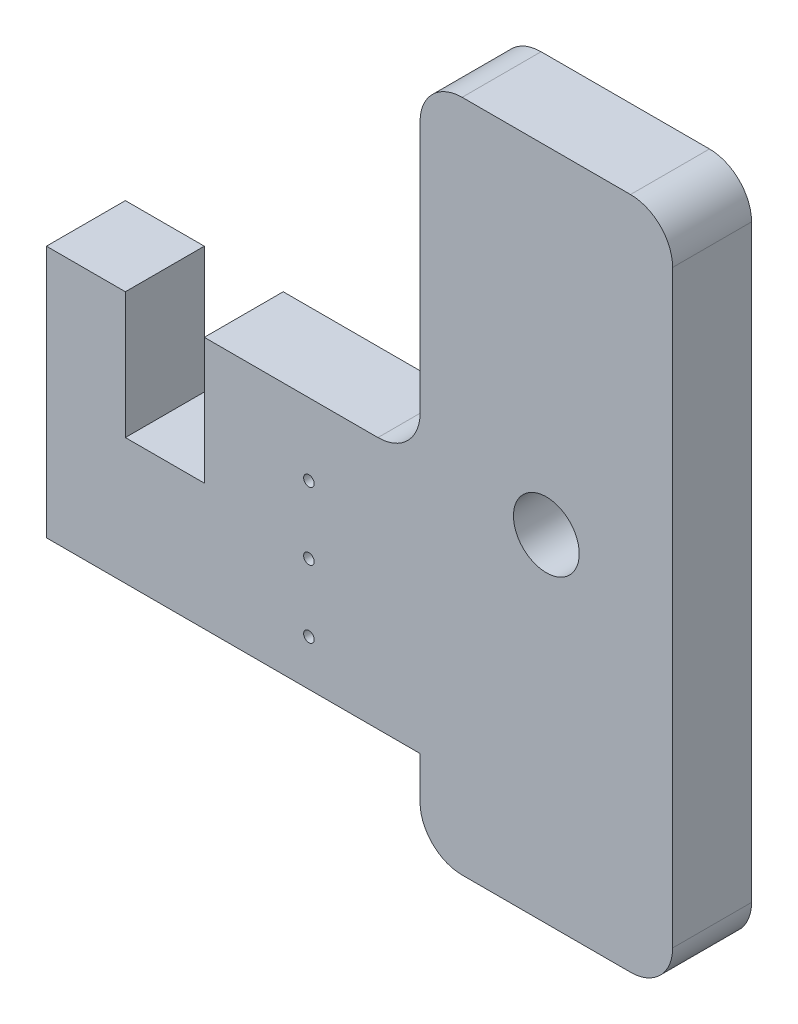
ISO-10303-21;
HEADER;
FILE_DESCRIPTION(('STEP AP214'),'2;1');
FILE_NAME('part.step','',(''),(''),'','','');
FILE_SCHEMA(('AUTOMOTIVE_DESIGN { 1 0 10303 214 1 1 1 1 }'));
ENDSEC;
DATA;
#1=APPLICATION_CONTEXT('core data for automotive mechanical design processes');
#2=APPLICATION_PROTOCOL_DEFINITION('international standard','automotive_design',2000,#1);
#3=PRODUCT_CONTEXT('',#1,'mechanical');
#4=PRODUCT('Part','Part','',(#3));
#5=PRODUCT_RELATED_PRODUCT_CATEGORY('part','',(#4));
#6=PRODUCT_DEFINITION_FORMATION('','',#4);
#7=PRODUCT_DEFINITION_CONTEXT('part definition',#1,'design');
#8=PRODUCT_DEFINITION('design','',#6,#7);
#9=PRODUCT_DEFINITION_SHAPE('','',#8);
#10=(LENGTH_UNIT() NAMED_UNIT(*) SI_UNIT(.MILLI.,.METRE.));
#11=(NAMED_UNIT(*) PLANE_ANGLE_UNIT() SI_UNIT($,.RADIAN.));
#12=(NAMED_UNIT(*) SI_UNIT($,.STERADIAN.) SOLID_ANGLE_UNIT());
#13=UNCERTAINTY_MEASURE_WITH_UNIT(LENGTH_MEASURE(1.E-05),#10,'distance_accuracy_value','');
#14=(GEOMETRIC_REPRESENTATION_CONTEXT(3) GLOBAL_UNCERTAINTY_ASSIGNED_CONTEXT((#13)) GLOBAL_UNIT_ASSIGNED_CONTEXT((#10,
#11,#12)) REPRESENTATION_CONTEXT('',''));
#15=CARTESIAN_POINT('',(0.,0.,0.));
#16=DIRECTION('',(0.,0.,1.));
#17=DIRECTION('',(1.,0.,0.));
#18=AXIS2_PLACEMENT_3D('',#15,#16,#17);
#19=CARTESIAN_POINT('',(0.,0.,9.525));
#20=DIRECTION('',(0.,1.,0.));
#21=DIRECTION('',(-1.,0.,0.));
#22=AXIS2_PLACEMENT_3D('',#19,#20,#21);
#23=PLANE('',#22);
#24=DIRECTION('',(1.,0.,0.));
#25=VECTOR('',#24,1.);
#26=CARTESIAN_POINT('',(0.,0.,9.525));
#27=LINE('',#26,#25);
#28=CARTESIAN_POINT('',(-41.275,0.,9.525));
#29=VERTEX_POINT('',#28);
#30=CARTESIAN_POINT('',(-20.32,0.,9.525));
#31=VERTEX_POINT('',#30);
#32=EDGE_CURVE('E163',#29,#31,#27,.T.);
#33=ORIENTED_EDGE('',*,*,#32,.T.);
#34=DIRECTION('',(0.,0.,-1.));
#35=VECTOR('',#34,1.);
#36=CARTESIAN_POINT('',(-20.32,0.,9.525));
#37=LINE('',#36,#35);
#38=CARTESIAN_POINT('',(-20.32,0.,0.));
#39=VERTEX_POINT('',#38);
#40=EDGE_CURVE('E171',#31,#39,#37,.T.);
#41=ORIENTED_EDGE('',*,*,#40,.T.);
#42=DIRECTION('',(1.,0.,0.));
#43=VECTOR('',#42,1.);
#44=CARTESIAN_POINT('',(0.,0.,0.));
#45=LINE('',#44,#43);
#46=CARTESIAN_POINT('',(-41.275,0.,0.));
#47=VERTEX_POINT('',#46);
#48=EDGE_CURVE('E166',#47,#39,#45,.T.);
#49=ORIENTED_EDGE('',*,*,#48,.F.);
#50=DIRECTION('',(0.,0.,-1.));
#51=VECTOR('',#50,1.);
#52=CARTESIAN_POINT('',(-41.275,0.,9.525));
#53=LINE('',#52,#51);
#54=EDGE_CURVE('E160',#29,#47,#53,.T.);
#55=ORIENTED_EDGE('',*,*,#54,.F.);
#56=EDGE_LOOP('',(#33,#41,#49,#55));
#57=FACE_BOUND('',#56,.T.);
#58=ADVANCED_FACE('F40',(#57),#23,.T.);
#59=CARTESIAN_POINT('',(-41.275,0.,9.525));
#60=DIRECTION('',(-1.,0.,0.));
#61=DIRECTION('',(0.,0.,1.));
#62=AXIS2_PLACEMENT_3D('',#59,#60,#61);
#63=PLANE('',#62);
#64=DIRECTION('',(0.,1.,0.));
#65=VECTOR('',#64,1.);
#66=CARTESIAN_POINT('',(-41.275,0.,0.));
#67=LINE('',#66,#65);
#68=CARTESIAN_POINT('',(-41.275,-15.24,0.));
#69=VERTEX_POINT('',#68);
#70=EDGE_CURVE('E218',#69,#47,#67,.T.);
#71=ORIENTED_EDGE('',*,*,#70,.F.);
#72=DIRECTION('',(0.,0.,-1.));
#73=VECTOR('',#72,1.);
#74=CARTESIAN_POINT('',(-41.275,-15.24,9.525));
#75=LINE('',#74,#73);
#76=CARTESIAN_POINT('',(-41.275,-15.24,9.525));
#77=VERTEX_POINT('',#76);
#78=EDGE_CURVE('E172',#77,#69,#75,.T.);
#79=ORIENTED_EDGE('',*,*,#78,.F.);
#80=DIRECTION('',(0.,1.,0.));
#81=VECTOR('',#80,1.);
#82=CARTESIAN_POINT('',(-41.275,0.,9.525));
#83=LINE('',#82,#81);
#84=EDGE_CURVE('E178',#77,#29,#83,.T.);
#85=ORIENTED_EDGE('',*,*,#84,.T.);
#86=ORIENTED_EDGE('',*,*,#54,.T.);
#87=EDGE_LOOP('',(#71,#79,#85,#86));
#88=FACE_BOUND('',#87,.T.);
#89=ADVANCED_FACE('F184',(#88),#63,.T.);
#90=CARTESIAN_POINT('',(0.,-15.24,9.525));
#91=DIRECTION('',(0.,1.,0.));
#92=DIRECTION('',(-1.,0.,0.));
#93=AXIS2_PLACEMENT_3D('',#90,#91,#92);
#94=PLANE('',#93);
#95=DIRECTION('',(1.,0.,0.));
#96=VECTOR('',#95,1.);
#97=CARTESIAN_POINT('',(0.,-15.24,0.));
#98=LINE('',#97,#96);
#99=CARTESIAN_POINT('',(-50.8,-15.24,0.));
#100=VERTEX_POINT('',#99);
#101=EDGE_CURVE('E220',#100,#69,#98,.T.);
#102=ORIENTED_EDGE('',*,*,#101,.F.);
#103=DIRECTION('',(0.,0.,-1.));
#104=VECTOR('',#103,1.);
#105=CARTESIAN_POINT('',(-50.8,-15.24,9.525));
#106=LINE('',#105,#104);
#107=CARTESIAN_POINT('',(-50.8,-15.24,9.525));
#108=VERTEX_POINT('',#107);
#109=EDGE_CURVE('E258',#108,#100,#106,.T.);
#110=ORIENTED_EDGE('',*,*,#109,.F.);
#111=DIRECTION('',(1.,0.,0.));
#112=VECTOR('',#111,1.);
#113=CARTESIAN_POINT('',(0.,-15.24,9.525));
#114=LINE('',#113,#112);
#115=EDGE_CURVE('E185',#108,#77,#114,.T.);
#116=ORIENTED_EDGE('',*,*,#115,.T.);
#117=ORIENTED_EDGE('',*,*,#78,.T.);
#118=EDGE_LOOP('',(#102,#110,#116,#117));
#119=FACE_BOUND('',#118,.T.);
#120=ADVANCED_FACE('F326',(#119),#94,.T.);
#121=CARTESIAN_POINT('',(-50.8,0.,9.525));
#122=DIRECTION('',(-1.,0.,0.));
#123=DIRECTION('',(0.,0.,1.));
#124=AXIS2_PLACEMENT_3D('',#121,#122,#123);
#125=PLANE('',#124);
#126=DIRECTION('',(0.,1.,0.));
#127=VECTOR('',#126,1.);
#128=CARTESIAN_POINT('',(-50.8,0.,0.));
#129=LINE('',#128,#127);
#130=CARTESIAN_POINT('',(-50.8,0.,0.));
#131=VERTEX_POINT('',#130);
#132=EDGE_CURVE('E223',#100,#131,#129,.T.);
#133=ORIENTED_EDGE('',*,*,#132,.T.);
#134=DIRECTION('',(0.,0.,-1.));
#135=VECTOR('',#134,1.);
#136=CARTESIAN_POINT('',(-50.8,0.,9.525));
#137=LINE('',#136,#135);
#138=CARTESIAN_POINT('',(-50.8,0.,9.525));
#139=VERTEX_POINT('',#138);
#140=EDGE_CURVE('E256',#139,#131,#137,.T.);
#141=ORIENTED_EDGE('',*,*,#140,.F.);
#142=DIRECTION('',(0.,1.,0.));
#143=VECTOR('',#142,1.);
#144=CARTESIAN_POINT('',(-50.8,0.,9.525));
#145=LINE('',#144,#143);
#146=EDGE_CURVE('E187',#108,#139,#145,.T.);
#147=ORIENTED_EDGE('',*,*,#146,.F.);
#148=ORIENTED_EDGE('',*,*,#109,.T.);
#149=EDGE_LOOP('',(#133,#141,#147,#148));
#150=FACE_BOUND('',#149,.T.);
#151=ADVANCED_FACE('F414',(#150),#125,.F.);
#152=CARTESIAN_POINT('',(0.,0.,9.525));
#153=DIRECTION('',(0.,1.,0.));
#154=DIRECTION('',(-1.,0.,0.));
#155=AXIS2_PLACEMENT_3D('',#152,#153,#154);
#156=PLANE('',#155);
#157=DIRECTION('',(1.,0.,0.));
#158=VECTOR('',#157,1.);
#159=CARTESIAN_POINT('',(0.,0.,0.));
#160=LINE('',#159,#158);
#161=CARTESIAN_POINT('',(-60.325,0.,0.));
#162=VERTEX_POINT('',#161);
#163=EDGE_CURVE('E226',#162,#131,#160,.T.);
#164=ORIENTED_EDGE('',*,*,#163,.F.);
#165=DIRECTION('',(0.,0.,-1.));
#166=VECTOR('',#165,1.);
#167=CARTESIAN_POINT('',(-60.325,0.,9.525));
#168=LINE('',#167,#166);
#169=CARTESIAN_POINT('',(-60.325,0.,9.525));
#170=VERTEX_POINT('',#169);
#171=EDGE_CURVE('E254',#170,#162,#168,.T.);
#172=ORIENTED_EDGE('',*,*,#171,.F.);
#173=DIRECTION('',(1.,0.,0.));
#174=VECTOR('',#173,1.);
#175=CARTESIAN_POINT('',(0.,0.,9.525));
#176=LINE('',#175,#174);
#177=EDGE_CURVE('E192',#170,#139,#176,.T.);
#178=ORIENTED_EDGE('',*,*,#177,.T.);
#179=ORIENTED_EDGE('',*,*,#140,.T.);
#180=EDGE_LOOP('',(#164,#172,#178,#179));
#181=FACE_BOUND('',#180,.T.);
#182=ADVANCED_FACE('F410',(#181),#156,.T.);
#183=CARTESIAN_POINT('',(-60.325,0.,9.525));
#184=DIRECTION('',(1.,0.,0.));
#185=DIRECTION('',(0.,1.,0.));
#186=AXIS2_PLACEMENT_3D('',#183,#184,#185);
#187=PLANE('',#186);
#188=DIRECTION('',(0.,-1.,0.));
#189=VECTOR('',#188,1.);
#190=CARTESIAN_POINT('',(-60.325,0.,0.));
#191=LINE('',#190,#189);
#192=CARTESIAN_POINT('',(-60.325,-30.48,0.));
#193=VERTEX_POINT('',#192);
#194=EDGE_CURVE('E229',#162,#193,#191,.T.);
#195=ORIENTED_EDGE('',*,*,#194,.T.);
#196=DIRECTION('',(0.,0.,-1.));
#197=VECTOR('',#196,1.);
#198=CARTESIAN_POINT('',(-60.325,-30.48,9.525));
#199=LINE('',#198,#197);
#200=CARTESIAN_POINT('',(-60.325,-30.48,9.525));
#201=VERTEX_POINT('',#200);
#202=EDGE_CURVE('E251',#201,#193,#199,.T.);
#203=ORIENTED_EDGE('',*,*,#202,.F.);
#204=DIRECTION('',(0.,-1.,0.));
#205=VECTOR('',#204,1.);
#206=CARTESIAN_POINT('',(-60.325,0.,9.525));
#207=LINE('',#206,#205);
#208=EDGE_CURVE('E195',#170,#201,#207,.T.);
#209=ORIENTED_EDGE('',*,*,#208,.F.);
#210=ORIENTED_EDGE('',*,*,#171,.T.);
#211=EDGE_LOOP('',(#195,#203,#209,#210));
#212=FACE_BOUND('',#211,.T.);
#213=ADVANCED_FACE('F406',(#212),#187,.F.);
#214=CARTESIAN_POINT('',(0.,-30.48,9.525));
#215=DIRECTION('',(0.,1.,0.));
#216=DIRECTION('',(-1.,0.,0.));
#217=AXIS2_PLACEMENT_3D('',#214,#215,#216);
#218=PLANE('',#217);
#219=DIRECTION('',(1.,0.,0.));
#220=VECTOR('',#219,1.);
#221=CARTESIAN_POINT('',(0.,-30.48,0.));
#222=LINE('',#221,#220);
#223=CARTESIAN_POINT('',(-15.24,-30.48,0.));
#224=VERTEX_POINT('',#223);
#225=EDGE_CURVE('E232',#193,#224,#222,.T.);
#226=ORIENTED_EDGE('',*,*,#225,.T.);
#227=DIRECTION('',(0.,0.,-1.));
#228=VECTOR('',#227,1.);
#229=CARTESIAN_POINT('',(-15.24,-30.48,9.525));
#230=LINE('',#229,#228);
#231=CARTESIAN_POINT('',(-15.24,-30.48,9.525));
#232=VERTEX_POINT('',#231);
#233=EDGE_CURVE('E212',#232,#224,#230,.T.);
#234=ORIENTED_EDGE('',*,*,#233,.F.);
#235=DIRECTION('',(1.,0.,0.));
#236=VECTOR('',#235,1.);
#237=CARTESIAN_POINT('',(0.,-30.48,9.525));
#238=LINE('',#237,#236);
#239=EDGE_CURVE('E198',#201,#232,#238,.T.);
#240=ORIENTED_EDGE('',*,*,#239,.F.);
#241=ORIENTED_EDGE('',*,*,#202,.T.);
#242=EDGE_LOOP('',(#226,#234,#240,#241));
#243=FACE_BOUND('',#242,.T.);
#244=ADVANCED_FACE('F402',(#243),#218,.F.);
#245=CARTESIAN_POINT('',(-15.24,0.,9.525));
#246=DIRECTION('',(-1.,0.,0.));
#247=DIRECTION('',(0.,0.,1.));
#248=AXIS2_PLACEMENT_3D('',#245,#246,#247);
#249=PLANE('',#248);
#250=DIRECTION('',(0.,1.,0.));
#251=VECTOR('',#250,1.);
#252=CARTESIAN_POINT('',(-15.24,0.,0.));
#253=LINE('',#252,#251);
#254=CARTESIAN_POINT('',(-15.24,-35.56,0.));
#255=VERTEX_POINT('',#254);
#256=EDGE_CURVE('E235',#255,#224,#253,.T.);
#257=ORIENTED_EDGE('',*,*,#256,.F.);
#258=DIRECTION('',(0.,0.,-1.));
#259=VECTOR('',#258,1.);
#260=CARTESIAN_POINT('',(-15.24,-35.56,9.525));
#261=LINE('',#260,#259);
#262=CARTESIAN_POINT('',(-15.24,-35.56,9.525));
#263=VERTEX_POINT('',#262);
#264=EDGE_CURVE('E280',#255,#263,#261,.F.);
#265=ORIENTED_EDGE('',*,*,#264,.T.);
#266=DIRECTION('',(0.,1.,0.));
#267=VECTOR('',#266,1.);
#268=CARTESIAN_POINT('',(-15.24,0.,9.525));
#269=LINE('',#268,#267);
#270=EDGE_CURVE('E201',#263,#232,#269,.T.);
#271=ORIENTED_EDGE('',*,*,#270,.T.);
#272=ORIENTED_EDGE('',*,*,#233,.T.);
#273=EDGE_LOOP('',(#257,#265,#271,#272));
#274=FACE_BOUND('',#273,.T.);
#275=ADVANCED_FACE('F398',(#274),#249,.T.);
#276=CARTESIAN_POINT('',(0.,-40.64,9.525));
#277=DIRECTION('',(0.,1.,0.));
#278=DIRECTION('',(0.,0.,1.));
#279=AXIS2_PLACEMENT_3D('',#276,#277,#278);
#280=PLANE('',#279);
#281=DIRECTION('',(1.,0.,0.));
#282=VECTOR('',#281,1.);
#283=CARTESIAN_POINT('',(0.,-40.64,9.525));
#284=LINE('',#283,#282);
#285=CARTESIAN_POINT('',(-10.16,-40.64,9.525));
#286=VERTEX_POINT('',#285);
#287=CARTESIAN_POINT('',(10.16,-40.64,9.525));
#288=VERTEX_POINT('',#287);
#289=EDGE_CURVE('E203',#286,#288,#284,.T.);
#290=ORIENTED_EDGE('',*,*,#289,.F.);
#291=DIRECTION('',(0.,0.,-1.));
#292=VECTOR('',#291,1.);
#293=CARTESIAN_POINT('',(-10.16,-40.64,0.));
#294=LINE('',#293,#292);
#295=CARTESIAN_POINT('',(-10.16,-40.64,0.));
#296=VERTEX_POINT('',#295);
#297=EDGE_CURVE('E269',#286,#296,#294,.T.);
#298=ORIENTED_EDGE('',*,*,#297,.T.);
#299=DIRECTION('',(1.,0.,0.));
#300=VECTOR('',#299,1.);
#301=CARTESIAN_POINT('',(0.,-40.64,0.));
#302=LINE('',#301,#300);
#303=CARTESIAN_POINT('',(10.16,-40.64,0.));
#304=VERTEX_POINT('',#303);
#305=EDGE_CURVE('E237',#296,#304,#302,.T.);
#306=ORIENTED_EDGE('',*,*,#305,.T.);
#307=DIRECTION('',(0.,0.,-1.));
#308=VECTOR('',#307,1.);
#309=CARTESIAN_POINT('',(10.16,-40.64,9.525));
#310=LINE('',#309,#308);
#311=EDGE_CURVE('E267',#304,#288,#310,.F.);
#312=ORIENTED_EDGE('',*,*,#311,.T.);
#313=EDGE_LOOP('',(#290,#298,#306,#312));
#314=FACE_BOUND('',#313,.T.);
#315=ADVANCED_FACE('F394',(#314),#280,.F.);
#316=CARTESIAN_POINT('',(15.24,0.,9.525));
#317=DIRECTION('',(-1.,0.,0.));
#318=DIRECTION('',(0.,0.,1.));
#319=AXIS2_PLACEMENT_3D('',#316,#317,#318);
#320=PLANE('',#319);
#321=DIRECTION('',(0.,1.,0.));
#322=VECTOR('',#321,1.);
#323=CARTESIAN_POINT('',(15.24,0.,0.));
#324=LINE('',#323,#322);
#325=CARTESIAN_POINT('',(15.24,-35.56,0.));
#326=VERTEX_POINT('',#325);
#327=CARTESIAN_POINT('',(15.24,35.56,0.));
#328=VERTEX_POINT('',#327);
#329=EDGE_CURVE('E240',#326,#328,#324,.T.);
#330=ORIENTED_EDGE('',*,*,#329,.T.);
#331=DIRECTION('',(0.,0.,-1.));
#332=VECTOR('',#331,1.);
#333=CARTESIAN_POINT('',(15.24,35.56,9.525));
#334=LINE('',#333,#332);
#335=CARTESIAN_POINT('',(15.24,35.56,9.525));
#336=VERTEX_POINT('',#335);
#337=EDGE_CURVE('E296',#328,#336,#334,.F.);
#338=ORIENTED_EDGE('',*,*,#337,.T.);
#339=DIRECTION('',(0.,1.,0.));
#340=VECTOR('',#339,1.);
#341=CARTESIAN_POINT('',(15.24,0.,9.525));
#342=LINE('',#341,#340);
#343=CARTESIAN_POINT('',(15.24,-35.56,9.525));
#344=VERTEX_POINT('',#343);
#345=EDGE_CURVE('E206',#344,#336,#342,.T.);
#346=ORIENTED_EDGE('',*,*,#345,.F.);
#347=DIRECTION('',(0.,0.,-1.));
#348=VECTOR('',#347,1.);
#349=CARTESIAN_POINT('',(15.24,-35.56,9.525));
#350=LINE('',#349,#348);
#351=EDGE_CURVE('E293',#344,#326,#350,.T.);
#352=ORIENTED_EDGE('',*,*,#351,.T.);
#353=EDGE_LOOP('',(#330,#338,#346,#352));
#354=FACE_BOUND('',#353,.T.);
#355=ADVANCED_FACE('F338',(#354),#320,.F.);
#356=CARTESIAN_POINT('',(0.,40.64,9.525));
#357=DIRECTION('',(0.,1.,0.));
#358=DIRECTION('',(0.,0.,1.));
#359=AXIS2_PLACEMENT_3D('',#356,#357,#358);
#360=PLANE('',#359);
#361=DIRECTION('',(1.,0.,0.));
#362=VECTOR('',#361,1.);
#363=CARTESIAN_POINT('',(0.,40.64,0.));
#364=LINE('',#363,#362);
#365=CARTESIAN_POINT('',(-10.16,40.64,0.));
#366=VERTEX_POINT('',#365);
#367=CARTESIAN_POINT('',(10.16,40.64,0.));
#368=VERTEX_POINT('',#367);
#369=EDGE_CURVE('E243',#366,#368,#364,.T.);
#370=ORIENTED_EDGE('',*,*,#369,.F.);
#371=DIRECTION('',(0.,0.,-1.));
#372=VECTOR('',#371,1.);
#373=CARTESIAN_POINT('',(-10.16,40.64,9.525));
#374=LINE('',#373,#372);
#375=CARTESIAN_POINT('',(-10.16,40.64,9.525));
#376=VERTEX_POINT('',#375);
#377=EDGE_CURVE('E62',#366,#376,#374,.F.);
#378=ORIENTED_EDGE('',*,*,#377,.T.);
#379=DIRECTION('',(1.,0.,0.));
#380=VECTOR('',#379,1.);
#381=CARTESIAN_POINT('',(0.,40.64,9.525));
#382=LINE('',#381,#380);
#383=CARTESIAN_POINT('',(10.16,40.64,9.525));
#384=VERTEX_POINT('',#383);
#385=EDGE_CURVE('E208',#376,#384,#382,.T.);
#386=ORIENTED_EDGE('',*,*,#385,.T.);
#387=DIRECTION('',(0.,0.,-1.));
#388=VECTOR('',#387,1.);
#389=CARTESIAN_POINT('',(10.16,40.64,0.));
#390=LINE('',#389,#388);
#391=EDGE_CURVE('E289',#384,#368,#390,.T.);
#392=ORIENTED_EDGE('',*,*,#391,.T.);
#393=EDGE_LOOP('',(#370,#378,#386,#392));
#394=FACE_BOUND('',#393,.T.);
#395=ADVANCED_FACE('F331',(#394),#360,.T.);
#396=CARTESIAN_POINT('',(0.,0.,9.525));
#397=DIRECTION('',(0.,0.,-1.));
#398=DIRECTION('',(-1.,0.,0.));
#399=AXIS2_PLACEMENT_3D('',#396,#397,#398);
#400=CYLINDRICAL_SURFACE('',#399,3.96875);
#401=CARTESIAN_POINT('',(0.,0.,9.525));
#402=DIRECTION('',(0.,0.,1.));
#403=DIRECTION('',(1.,0.,0.));
#404=AXIS2_PLACEMENT_3D('',#401,#402,#403);
#405=CIRCLE('',#404,3.96875);
#406=CARTESIAN_POINT('',(3.96875,0.,9.525));
#407=VERTEX_POINT('',#406);
#408=EDGE_CURVE('E182',#407,#407,#405,.T.);
#409=ORIENTED_EDGE('',*,*,#408,.T.);
#410=EDGE_LOOP('',(#409));
#411=FACE_BOUND('',#410,.T.);
#412=CARTESIAN_POINT('',(0.,0.,0.));
#413=DIRECTION('',(0.,0.,1.));
#414=DIRECTION('',(1.,0.,0.));
#415=AXIS2_PLACEMENT_3D('',#412,#413,#414);
#416=CIRCLE('',#415,3.96875);
#417=CARTESIAN_POINT('',(3.96875,0.,0.));
#418=VERTEX_POINT('',#417);
#419=EDGE_CURVE('E213',#418,#418,#416,.T.);
#420=ORIENTED_EDGE('',*,*,#419,.F.);
#421=EDGE_LOOP('',(#420));
#422=FACE_BOUND('',#421,.T.);
#423=ADVANCED_FACE('F329',(#411,#422),#400,.F.);
#424=CARTESIAN_POINT('',(-15.24,0.,9.525));
#425=DIRECTION('',(1.,0.,0.));
#426=DIRECTION('',(0.,1.,0.));
#427=AXIS2_PLACEMENT_3D('',#424,#425,#426);
#428=PLANE('',#427);
#429=DIRECTION('',(0.,-1.,0.));
#430=VECTOR('',#429,1.);
#431=CARTESIAN_POINT('',(-15.24,0.,0.));
#432=LINE('',#431,#430);
#433=CARTESIAN_POINT('',(-15.24,35.56,0.));
#434=VERTEX_POINT('',#433);
#435=CARTESIAN_POINT('',(-15.24,5.08000000000002,0.));
#436=VERTEX_POINT('',#435);
#437=EDGE_CURVE('E246',#434,#436,#432,.T.);
#438=ORIENTED_EDGE('',*,*,#437,.T.);
#439=DIRECTION('',(0.,0.,-1.));
#440=VECTOR('',#439,1.);
#441=CARTESIAN_POINT('',(-15.24,5.08000000000002,9.525));
#442=LINE('',#441,#440);
#443=CARTESIAN_POINT('',(-15.24,5.08000000000002,9.525));
#444=VERTEX_POINT('',#443);
#445=EDGE_CURVE('E265',#436,#444,#442,.F.);
#446=ORIENTED_EDGE('',*,*,#445,.T.);
#447=DIRECTION('',(0.,-1.,0.));
#448=VECTOR('',#447,1.);
#449=CARTESIAN_POINT('',(-15.24,0.,9.525));
#450=LINE('',#449,#448);
#451=CARTESIAN_POINT('',(-15.24,35.56,9.525));
#452=VERTEX_POINT('',#451);
#453=EDGE_CURVE('E210',#452,#444,#450,.T.);
#454=ORIENTED_EDGE('',*,*,#453,.F.);
#455=DIRECTION('',(0.,0.,-1.));
#456=VECTOR('',#455,1.);
#457=CARTESIAN_POINT('',(-15.24,35.56,0.));
#458=LINE('',#457,#456);
#459=EDGE_CURVE('E262',#452,#434,#458,.T.);
#460=ORIENTED_EDGE('',*,*,#459,.T.);
#461=EDGE_LOOP('',(#438,#446,#454,#460));
#462=FACE_BOUND('',#461,.T.);
#463=ADVANCED_FACE('F304',(#462),#428,.F.);
#464=CARTESIAN_POINT('',(0.,0.,9.525));
#465=DIRECTION('',(0.,0.,1.));
#466=DIRECTION('',(1.,0.,0.));
#467=AXIS2_PLACEMENT_3D('',#464,#465,#466);
#468=PLANE('',#467);
#469=CARTESIAN_POINT('',(-28.6512000000001,-8.68299999999999,9.525));
#470=DIRECTION('',(0.,0.,1.));
#471=DIRECTION('',(1.,0.,0.));
#472=AXIS2_PLACEMENT_3D('',#469,#470,#471);
#473=CIRCLE('',#472,0.634999999999999);
#474=CARTESIAN_POINT('',(-28.0162000000001,-8.68299999999999,9.525));
#475=VERTEX_POINT('',#474);
#476=EDGE_CURVE('E357',#475,#475,#473,.T.);
#477=ORIENTED_EDGE('',*,*,#476,.F.);
#478=EDGE_LOOP('',(#477));
#479=FACE_BOUND('',#478,.T.);
#480=CARTESIAN_POINT('',(-28.6512000000001,-16.8255456111321,9.525));
#481=DIRECTION('',(0.,0.,1.));
#482=DIRECTION('',(1.,0.,0.));
#483=AXIS2_PLACEMENT_3D('',#480,#481,#482);
#484=CIRCLE('',#483,0.634999999999999);
#485=CARTESIAN_POINT('',(-28.0162000000001,-16.8255456111321,9.525));
#486=VERTEX_POINT('',#485);
#487=EDGE_CURVE('E350',#486,#486,#484,.T.);
#488=ORIENTED_EDGE('',*,*,#487,.F.);
#489=EDGE_LOOP('',(#488));
#490=FACE_BOUND('',#489,.T.);
#491=CARTESIAN_POINT('',(-28.6512000000001,-24.9680912222642,9.525));
#492=DIRECTION('',(0.,0.,1.));
#493=DIRECTION('',(1.,0.,0.));
#494=AXIS2_PLACEMENT_3D('',#491,#492,#493);
#495=CIRCLE('',#494,0.634999999999999);
#496=CARTESIAN_POINT('',(-28.0162000000001,-24.9680912222642,9.525));
#497=VERTEX_POINT('',#496);
#498=EDGE_CURVE('E351',#497,#497,#495,.T.);
#499=ORIENTED_EDGE('',*,*,#498,.F.);
#500=EDGE_LOOP('',(#499));
#501=FACE_BOUND('',#500,.T.);
#502=ORIENTED_EDGE('',*,*,#408,.F.);
#503=EDGE_LOOP('',(#502));
#504=FACE_BOUND('',#503,.T.);
#505=ORIENTED_EDGE('',*,*,#270,.F.);
#506=CARTESIAN_POINT('',(-10.16,-35.56,9.525));
#507=DIRECTION('',(0.,0.,1.));
#508=DIRECTION('',(1.,0.,0.));
#509=AXIS2_PLACEMENT_3D('',#506,#507,#508);
#510=CIRCLE('',#509,5.08);
#511=EDGE_CURVE('E287',#263,#286,#510,.T.);
#512=ORIENTED_EDGE('',*,*,#511,.T.);
#513=ORIENTED_EDGE('',*,*,#289,.T.);
#514=CARTESIAN_POINT('',(10.16,-35.56,9.525));
#515=DIRECTION('',(0.,0.,1.));
#516=DIRECTION('',(1.,0.,0.));
#517=AXIS2_PLACEMENT_3D('',#514,#515,#516);
#518=CIRCLE('',#517,5.08);
#519=EDGE_CURVE('E282',#288,#344,#518,.T.);
#520=ORIENTED_EDGE('',*,*,#519,.T.);
#521=ORIENTED_EDGE('',*,*,#345,.T.);
#522=CARTESIAN_POINT('',(10.16,35.56,9.525));
#523=DIRECTION('',(0.,0.,1.));
#524=DIRECTION('',(1.,0.,0.));
#525=AXIS2_PLACEMENT_3D('',#522,#523,#524);
#526=CIRCLE('',#525,5.08);
#527=EDGE_CURVE('E55',#336,#384,#526,.T.);
#528=ORIENTED_EDGE('',*,*,#527,.T.);
#529=ORIENTED_EDGE('',*,*,#385,.F.);
#530=CARTESIAN_POINT('',(-10.16,35.56,9.525));
#531=DIRECTION('',(0.,0.,1.));
#532=DIRECTION('',(1.,0.,0.));
#533=AXIS2_PLACEMENT_3D('',#530,#531,#532);
#534=CIRCLE('',#533,5.08);
#535=EDGE_CURVE('E285',#376,#452,#534,.T.);
#536=ORIENTED_EDGE('',*,*,#535,.T.);
#537=ORIENTED_EDGE('',*,*,#453,.T.);
#538=CARTESIAN_POINT('',(-20.32,5.08000000000002,9.525));
#539=DIRECTION('',(0.,0.,1.));
#540=DIRECTION('',(1.,0.,0.));
#541=AXIS2_PLACEMENT_3D('',#538,#539,#540);
#542=CIRCLE('',#541,5.08);
#543=EDGE_CURVE('E11',#444,#31,#542,.F.);
#544=ORIENTED_EDGE('',*,*,#543,.T.);
#545=ORIENTED_EDGE('',*,*,#32,.F.);
#546=ORIENTED_EDGE('',*,*,#84,.F.);
#547=ORIENTED_EDGE('',*,*,#115,.F.);
#548=ORIENTED_EDGE('',*,*,#146,.T.);
#549=ORIENTED_EDGE('',*,*,#177,.F.);
#550=ORIENTED_EDGE('',*,*,#208,.T.);
#551=ORIENTED_EDGE('',*,*,#239,.T.);
#552=EDGE_LOOP('',(#505,#512,#513,#520,#521,#528,#529,#536,#537,#544,#545,#546,#547,#548,#549,
#550,#551));
#553=FACE_BOUND('',#552,.T.);
#554=ADVANCED_FACE('F176',(#479,#490,#501,#504,#553),#468,.T.);
#555=CARTESIAN_POINT('',(0.,0.,0.));
#556=DIRECTION('',(0.,0.,1.));
#557=DIRECTION('',(1.,0.,0.));
#558=AXIS2_PLACEMENT_3D('',#555,#556,#557);
#559=PLANE('',#558);
#560=CARTESIAN_POINT('',(-28.6512000000001,-8.68299999999999,0.));
#561=DIRECTION('',(0.,0.,1.));
#562=DIRECTION('',(1.,0.,0.));
#563=AXIS2_PLACEMENT_3D('',#560,#561,#562);
#564=CIRCLE('',#563,0.634999999999999);
#565=CARTESIAN_POINT('',(-28.0162000000001,-8.68299999999999,0.));
#566=VERTEX_POINT('',#565);
#567=EDGE_CURVE('E216',#566,#566,#564,.F.);
#568=ORIENTED_EDGE('',*,*,#567,.F.);
#569=EDGE_LOOP('',(#568));
#570=FACE_BOUND('',#569,.T.);
#571=CARTESIAN_POINT('',(-28.6512000000001,-16.8255456111321,0.));
#572=DIRECTION('',(0.,0.,1.));
#573=DIRECTION('',(1.,0.,0.));
#574=AXIS2_PLACEMENT_3D('',#571,#572,#573);
#575=CIRCLE('',#574,0.634999999999999);
#576=CARTESIAN_POINT('',(-28.0162000000001,-16.8255456111321,0.));
#577=VERTEX_POINT('',#576);
#578=EDGE_CURVE('E354',#577,#577,#575,.F.);
#579=ORIENTED_EDGE('',*,*,#578,.F.);
#580=EDGE_LOOP('',(#579));
#581=FACE_BOUND('',#580,.T.);
#582=CARTESIAN_POINT('',(-28.6512000000001,-24.9680912222642,0.));
#583=DIRECTION('',(0.,0.,1.));
#584=DIRECTION('',(1.,0.,0.));
#585=AXIS2_PLACEMENT_3D('',#582,#583,#584);
#586=CIRCLE('',#585,0.634999999999999);
#587=CARTESIAN_POINT('',(-28.0162000000001,-24.9680912222642,0.));
#588=VERTEX_POINT('',#587);
#589=EDGE_CURVE('E347',#588,#588,#586,.F.);
#590=ORIENTED_EDGE('',*,*,#589,.F.);
#591=EDGE_LOOP('',(#590));
#592=FACE_BOUND('',#591,.T.);
#593=ORIENTED_EDGE('',*,*,#419,.T.);
#594=EDGE_LOOP('',(#593));
#595=FACE_BOUND('',#594,.T.);
#596=ORIENTED_EDGE('',*,*,#305,.F.);
#597=CARTESIAN_POINT('',(-10.16,-35.56,0.));
#598=DIRECTION('',(0.,0.,1.));
#599=DIRECTION('',(1.,0.,0.));
#600=AXIS2_PLACEMENT_3D('',#597,#598,#599);
#601=CIRCLE('',#600,5.08);
#602=EDGE_CURVE('E278',#296,#255,#601,.F.);
#603=ORIENTED_EDGE('',*,*,#602,.T.);
#604=ORIENTED_EDGE('',*,*,#256,.T.);
#605=ORIENTED_EDGE('',*,*,#225,.F.);
#606=ORIENTED_EDGE('',*,*,#194,.F.);
#607=ORIENTED_EDGE('',*,*,#163,.T.);
#608=ORIENTED_EDGE('',*,*,#132,.F.);
#609=ORIENTED_EDGE('',*,*,#101,.T.);
#610=ORIENTED_EDGE('',*,*,#70,.T.);
#611=ORIENTED_EDGE('',*,*,#48,.T.);
#612=CARTESIAN_POINT('',(-20.32,5.08000000000002,0.));
#613=DIRECTION('',(0.,0.,1.));
#614=DIRECTION('',(1.,0.,0.));
#615=AXIS2_PLACEMENT_3D('',#612,#613,#614);
#616=CIRCLE('',#615,5.08);
#617=EDGE_CURVE('E48',#39,#436,#616,.T.);
#618=ORIENTED_EDGE('',*,*,#617,.T.);
#619=ORIENTED_EDGE('',*,*,#437,.F.);
#620=CARTESIAN_POINT('',(-10.16,35.56,0.));
#621=DIRECTION('',(0.,0.,1.));
#622=DIRECTION('',(1.,0.,0.));
#623=AXIS2_PLACEMENT_3D('',#620,#621,#622);
#624=CIRCLE('',#623,5.08);
#625=EDGE_CURVE('E276',#434,#366,#624,.F.);
#626=ORIENTED_EDGE('',*,*,#625,.T.);
#627=ORIENTED_EDGE('',*,*,#369,.T.);
#628=CARTESIAN_POINT('',(10.16,35.56,0.));
#629=DIRECTION('',(0.,0.,1.));
#630=DIRECTION('',(1.,0.,0.));
#631=AXIS2_PLACEMENT_3D('',#628,#629,#630);
#632=CIRCLE('',#631,5.08);
#633=EDGE_CURVE('E274',#368,#328,#632,.F.);
#634=ORIENTED_EDGE('',*,*,#633,.T.);
#635=ORIENTED_EDGE('',*,*,#329,.F.);
#636=CARTESIAN_POINT('',(10.16,-35.56,0.));
#637=DIRECTION('',(0.,0.,1.));
#638=DIRECTION('',(1.,0.,0.));
#639=AXIS2_PLACEMENT_3D('',#636,#637,#638);
#640=CIRCLE('',#639,5.08);
#641=EDGE_CURVE('E272',#326,#304,#640,.F.);
#642=ORIENTED_EDGE('',*,*,#641,.T.);
#643=EDGE_LOOP('',(#596,#603,#604,#605,#606,#607,#608,#609,#610,#611,#618,#619,#626,#627,#634,
#635,#642));
#644=FACE_BOUND('',#643,.T.);
#645=ADVANCED_FACE('F300',(#570,#581,#592,#595,#644),#559,.F.);
#646=CARTESIAN_POINT('',(-20.32,5.08000000000002,9.525));
#647=DIRECTION('',(0.,0.,-1.));
#648=DIRECTION('',(-1.,0.,0.));
#649=AXIS2_PLACEMENT_3D('',#646,#647,#648);
#650=CYLINDRICAL_SURFACE('',#649,5.08);
#651=ORIENTED_EDGE('',*,*,#543,.F.);
#652=ORIENTED_EDGE('',*,*,#445,.F.);
#653=ORIENTED_EDGE('',*,*,#617,.F.);
#654=ORIENTED_EDGE('',*,*,#40,.F.);
#655=EDGE_LOOP('',(#651,#652,#653,#654));
#656=FACE_BOUND('',#655,.T.);
#657=ADVANCED_FACE('F307',(#656),#650,.F.);
#658=CARTESIAN_POINT('',(-10.16,-35.56,9.525));
#659=DIRECTION('',(0.,0.,1.));
#660=DIRECTION('',(1.,0.,0.));
#661=AXIS2_PLACEMENT_3D('',#658,#659,#660);
#662=CYLINDRICAL_SURFACE('',#661,5.08);
#663=ORIENTED_EDGE('',*,*,#511,.F.);
#664=ORIENTED_EDGE('',*,*,#264,.F.);
#665=ORIENTED_EDGE('',*,*,#602,.F.);
#666=ORIENTED_EDGE('',*,*,#297,.F.);
#667=EDGE_LOOP('',(#663,#664,#665,#666));
#668=FACE_BOUND('',#667,.T.);
#669=ADVANCED_FACE('F309',(#668),#662,.T.);
#670=CARTESIAN_POINT('',(-10.16,35.56,9.525));
#671=DIRECTION('',(0.,0.,1.));
#672=DIRECTION('',(1.,0.,0.));
#673=AXIS2_PLACEMENT_3D('',#670,#671,#672);
#674=CYLINDRICAL_SURFACE('',#673,5.08);
#675=ORIENTED_EDGE('',*,*,#535,.F.);
#676=ORIENTED_EDGE('',*,*,#377,.F.);
#677=ORIENTED_EDGE('',*,*,#625,.F.);
#678=ORIENTED_EDGE('',*,*,#459,.F.);
#679=EDGE_LOOP('',(#675,#676,#677,#678));
#680=FACE_BOUND('',#679,.T.);
#681=ADVANCED_FACE('F315',(#680),#674,.T.);
#682=CARTESIAN_POINT('',(10.16,35.56,9.525));
#683=DIRECTION('',(0.,0.,1.));
#684=DIRECTION('',(1.,0.,0.));
#685=AXIS2_PLACEMENT_3D('',#682,#683,#684);
#686=CYLINDRICAL_SURFACE('',#685,5.08);
#687=ORIENTED_EDGE('',*,*,#527,.F.);
#688=ORIENTED_EDGE('',*,*,#337,.F.);
#689=ORIENTED_EDGE('',*,*,#633,.F.);
#690=ORIENTED_EDGE('',*,*,#391,.F.);
#691=EDGE_LOOP('',(#687,#688,#689,#690));
#692=FACE_BOUND('',#691,.T.);
#693=ADVANCED_FACE('F388',(#692),#686,.T.);
#694=CARTESIAN_POINT('',(10.16,-35.56,9.525));
#695=DIRECTION('',(0.,0.,-1.));
#696=DIRECTION('',(-1.,0.,0.));
#697=AXIS2_PLACEMENT_3D('',#694,#695,#696);
#698=CYLINDRICAL_SURFACE('',#697,5.08);
#699=ORIENTED_EDGE('',*,*,#519,.F.);
#700=ORIENTED_EDGE('',*,*,#311,.F.);
#701=ORIENTED_EDGE('',*,*,#641,.F.);
#702=ORIENTED_EDGE('',*,*,#351,.F.);
#703=EDGE_LOOP('',(#699,#700,#701,#702));
#704=FACE_BOUND('',#703,.T.);
#705=ADVANCED_FACE('F42',(#704),#698,.T.);
#706=CARTESIAN_POINT('',(-28.6512000000001,-24.9680912222642,-0.000999999999999265));
#707=DIRECTION('',(0.,0.,1.));
#708=DIRECTION('',(1.,0.,0.));
#709=AXIS2_PLACEMENT_3D('',#706,#707,#708);
#710=CYLINDRICAL_SURFACE('',#709,0.634999999999999);
#711=ORIENTED_EDGE('',*,*,#498,.T.);
#712=EDGE_LOOP('',(#711));
#713=FACE_BOUND('',#712,.T.);
#714=ORIENTED_EDGE('',*,*,#589,.T.);
#715=EDGE_LOOP('',(#714));
#716=FACE_BOUND('',#715,.T.);
#717=ADVANCED_FACE('F375',(#713,#716),#710,.F.);
#718=CARTESIAN_POINT('',(-28.6512000000001,-16.8255456111321,-0.000999999999999265));
#719=DIRECTION('',(0.,0.,1.));
#720=DIRECTION('',(1.,0.,0.));
#721=AXIS2_PLACEMENT_3D('',#718,#719,#720);
#722=CYLINDRICAL_SURFACE('',#721,0.634999999999999);
#723=ORIENTED_EDGE('',*,*,#487,.T.);
#724=EDGE_LOOP('',(#723));
#725=FACE_BOUND('',#724,.T.);
#726=ORIENTED_EDGE('',*,*,#578,.T.);
#727=EDGE_LOOP('',(#726));
#728=FACE_BOUND('',#727,.T.);
#729=ADVANCED_FACE('F378',(#725,#728),#722,.F.);
#730=CARTESIAN_POINT('',(-28.6512000000001,-8.68299999999999,-0.000999999999999265));
#731=DIRECTION('',(0.,0.,1.));
#732=DIRECTION('',(1.,0.,0.));
#733=AXIS2_PLACEMENT_3D('',#730,#731,#732);
#734=CYLINDRICAL_SURFACE('',#733,0.634999999999999);
#735=ORIENTED_EDGE('',*,*,#476,.T.);
#736=EDGE_LOOP('',(#735));
#737=FACE_BOUND('',#736,.T.);
#738=ORIENTED_EDGE('',*,*,#567,.T.);
#739=EDGE_LOOP('',(#738));
#740=FACE_BOUND('',#739,.T.);
#741=ADVANCED_FACE('F365',(#737,#740),#734,.F.);
#742=CLOSED_SHELL('',(#58,#89,#120,#151,#182,#213,#244,#275,#315,#355,#395,#423,#463,#554,#645,
#657,#669,#681,#693,#705,#717,#729,#741));
#743=MANIFOLD_SOLID_BREP('B2',#742);
#744=ADVANCED_BREP_SHAPE_REPRESENTATION('',(#18,#743),#14);
#745=SHAPE_DEFINITION_REPRESENTATION(#9,#744);
ENDSEC;
END-ISO-10303-21;
